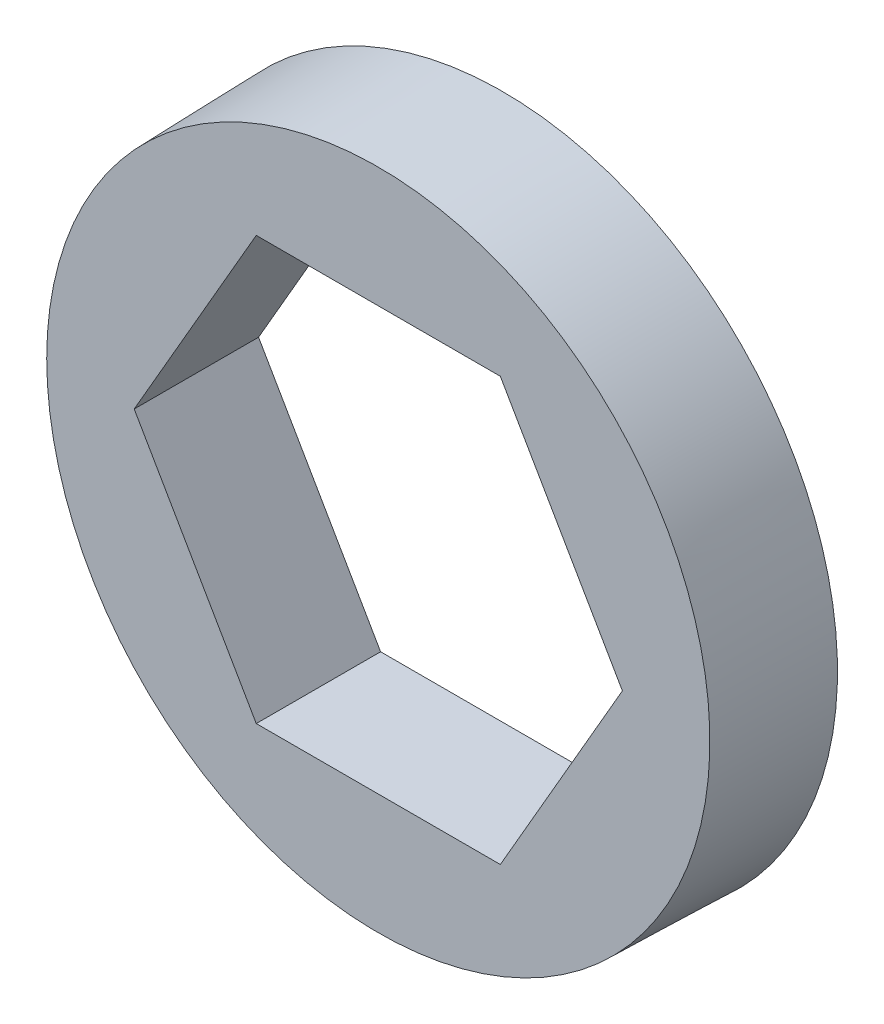
ISO-10303-21;
HEADER;
FILE_DESCRIPTION(('STEP AP214'),'2;1');
FILE_NAME('part.step','',(''),(''),'','','');
FILE_SCHEMA(('AUTOMOTIVE_DESIGN { 1 0 10303 214 1 1 1 1 }'));
ENDSEC;
DATA;
#1=APPLICATION_CONTEXT('core data for automotive mechanical design processes');
#2=APPLICATION_PROTOCOL_DEFINITION('international standard','automotive_design',2000,#1);
#3=PRODUCT_CONTEXT('',#1,'mechanical');
#4=PRODUCT('Part','Part','',(#3));
#5=PRODUCT_RELATED_PRODUCT_CATEGORY('part','',(#4));
#6=PRODUCT_DEFINITION_FORMATION('','',#4);
#7=PRODUCT_DEFINITION_CONTEXT('part definition',#1,'design');
#8=PRODUCT_DEFINITION('design','',#6,#7);
#9=PRODUCT_DEFINITION_SHAPE('','',#8);
#10=(LENGTH_UNIT() NAMED_UNIT(*) SI_UNIT(.MILLI.,.METRE.));
#11=(NAMED_UNIT(*) PLANE_ANGLE_UNIT() SI_UNIT($,.RADIAN.));
#12=(NAMED_UNIT(*) SI_UNIT($,.STERADIAN.) SOLID_ANGLE_UNIT());
#13=UNCERTAINTY_MEASURE_WITH_UNIT(LENGTH_MEASURE(1.E-05),#10,'distance_accuracy_value','');
#14=(GEOMETRIC_REPRESENTATION_CONTEXT(3) GLOBAL_UNCERTAINTY_ASSIGNED_CONTEXT((#13)) GLOBAL_UNIT_ASSIGNED_CONTEXT((#10,
#11,#12)) REPRESENTATION_CONTEXT('',''));
#15=CARTESIAN_POINT('',(0.,0.,0.));
#16=DIRECTION('',(0.,0.,1.));
#17=DIRECTION('',(1.,0.,0.));
#18=AXIS2_PLACEMENT_3D('',#15,#16,#17);
#19=CARTESIAN_POINT('',(0.,0.,0.75));
#20=DIRECTION('',(0.,0.,1.));
#21=DIRECTION('',(1.,0.,0.));
#22=AXIS2_PLACEMENT_3D('',#19,#20,#21);
#23=PLANE('',#22);
#24=CARTESIAN_POINT('',(0.,0.,0.749999999982265));
#25=DIRECTION('',(0.,0.,-1.));
#26=DIRECTION('',(-1.,0.,0.));
#27=AXIS2_PLACEMENT_3D('',#24,#25,#26);
#28=CIRCLE('',#27,3.99999999999778);
#29=CARTESIAN_POINT('',(-3.99999999999778,0.,0.749999999982265));
#30=VERTEX_POINT('',#29);
#31=EDGE_CURVE('E20',#30,#30,#28,.T.);
#32=ORIENTED_EDGE('',*,*,#31,.F.);
#33=EDGE_LOOP('',(#32));
#34=FACE_BOUND('',#33,.T.);
#35=DIRECTION('',(-0.5,-0.866025403784439,0.));
#36=VECTOR('',#35,1.);
#37=CARTESIAN_POINT('',(-1.47224318643355,2.55,0.75));
#38=LINE('',#37,#36);
#39=CARTESIAN_POINT('',(-2.94448637286709,0.,0.750000000000001));
#40=VERTEX_POINT('',#39);
#41=CARTESIAN_POINT('',(-1.47224318643355,2.55,0.75));
#42=VERTEX_POINT('',#41);
#43=EDGE_CURVE('E91',#40,#42,#38,.F.);
#44=ORIENTED_EDGE('',*,*,#43,.T.);
#45=DIRECTION('',(1.,0.,0.));
#46=VECTOR('',#45,1.);
#47=CARTESIAN_POINT('',(1.47224318643355,2.55,0.75));
#48=LINE('',#47,#46);
#49=CARTESIAN_POINT('',(1.47224318643355,2.55,0.75));
#50=VERTEX_POINT('',#49);
#51=EDGE_CURVE('E96',#42,#50,#48,.T.);
#52=ORIENTED_EDGE('',*,*,#51,.T.);
#53=DIRECTION('',(-0.5,0.866025403784439,0.));
#54=VECTOR('',#53,1.);
#55=CARTESIAN_POINT('',(2.94448637286709,0.,0.75));
#56=LINE('',#55,#54);
#57=CARTESIAN_POINT('',(2.94448637286709,0.,0.75));
#58=VERTEX_POINT('',#57);
#59=EDGE_CURVE('E101',#50,#58,#56,.F.);
#60=ORIENTED_EDGE('',*,*,#59,.T.);
#61=DIRECTION('',(0.5,0.866025403784439,0.));
#62=VECTOR('',#61,1.);
#63=CARTESIAN_POINT('',(1.47224318643355,-2.55,0.75));
#64=LINE('',#63,#62);
#65=CARTESIAN_POINT('',(1.47224318643355,-2.55,0.75));
#66=VERTEX_POINT('',#65);
#67=EDGE_CURVE('E71',#58,#66,#64,.F.);
#68=ORIENTED_EDGE('',*,*,#67,.T.);
#69=DIRECTION('',(1.,0.,0.));
#70=VECTOR('',#69,1.);
#71=CARTESIAN_POINT('',(-1.47224318643354,-2.55,0.75));
#72=LINE('',#71,#70);
#73=CARTESIAN_POINT('',(-1.47224318643355,-2.55,0.75));
#74=VERTEX_POINT('',#73);
#75=EDGE_CURVE('E70',#66,#74,#72,.F.);
#76=ORIENTED_EDGE('',*,*,#75,.T.);
#77=DIRECTION('',(0.5,-0.866025403784439,0.));
#78=VECTOR('',#77,1.);
#79=CARTESIAN_POINT('',(-2.94448637286709,0.,0.750000000000001));
#80=LINE('',#79,#78);
#81=EDGE_CURVE('E67',#74,#40,#80,.F.);
#82=ORIENTED_EDGE('',*,*,#81,.T.);
#83=EDGE_LOOP('',(#44,#52,#60,#68,#76,#82));
#84=FACE_BOUND('',#83,.T.);
#85=ADVANCED_FACE('F17',(#34,#84),#23,.T.);
#86=CARTESIAN_POINT('',(-1.47224318643354,-2.55,0.));
#87=DIRECTION('',(0.,-1.,0.));
#88=DIRECTION('',(0.,0.,-1.));
#89=AXIS2_PLACEMENT_3D('',#86,#87,#88);
#90=PLANE('',#89);
#91=DIRECTION('',(0.,0.,1.));
#92=VECTOR('',#91,1.);
#93=CARTESIAN_POINT('',(-1.47224318643355,-2.55,0.));
#94=LINE('',#93,#92);
#95=CARTESIAN_POINT('',(-1.47224318643355,-2.55,-0.75));
#96=VERTEX_POINT('',#95);
#97=EDGE_CURVE('E76',#96,#74,#94,.T.);
#98=ORIENTED_EDGE('',*,*,#97,.T.);
#99=ORIENTED_EDGE('',*,*,#75,.F.);
#100=DIRECTION('',(0.,0.,1.));
#101=VECTOR('',#100,1.);
#102=CARTESIAN_POINT('',(1.47224318643355,-2.55,0.));
#103=LINE('',#102,#101);
#104=CARTESIAN_POINT('',(1.47224318643355,-2.55,-0.75));
#105=VERTEX_POINT('',#104);
#106=EDGE_CURVE('E105',#66,#105,#103,.F.);
#107=ORIENTED_EDGE('',*,*,#106,.T.);
#108=DIRECTION('',(1.,0.,0.));
#109=VECTOR('',#108,1.);
#110=CARTESIAN_POINT('',(0.,-2.55,-0.75));
#111=LINE('',#110,#109);
#112=EDGE_CURVE('E87',#105,#96,#111,.F.);
#113=ORIENTED_EDGE('',*,*,#112,.T.);
#114=EDGE_LOOP('',(#98,#99,#107,#113));
#115=FACE_BOUND('',#114,.T.);
#116=ADVANCED_FACE('F86',(#115),#90,.F.);
#117=CARTESIAN_POINT('',(-2.94448637286709,0.,0.));
#118=DIRECTION('',(-0.866025403784439,-0.5,0.));
#119=DIRECTION('',(0.5,-0.866025403784439,0.));
#120=AXIS2_PLACEMENT_3D('',#117,#118,#119);
#121=PLANE('',#120);
#122=DIRECTION('',(0.,0.,1.));
#123=VECTOR('',#122,1.);
#124=CARTESIAN_POINT('',(-2.94448637286709,0.,0.));
#125=LINE('',#124,#123);
#126=CARTESIAN_POINT('',(-2.94448637286709,0.,-0.75));
#127=VERTEX_POINT('',#126);
#128=EDGE_CURVE('E83',#127,#40,#125,.T.);
#129=ORIENTED_EDGE('',*,*,#128,.T.);
#130=ORIENTED_EDGE('',*,*,#81,.F.);
#131=ORIENTED_EDGE('',*,*,#97,.F.);
#132=DIRECTION('',(-0.5,0.866025403784439,0.));
#133=VECTOR('',#132,1.);
#134=CARTESIAN_POINT('',(-1.47224318643355,-2.55,-0.75));
#135=LINE('',#134,#133);
#136=EDGE_CURVE('E108',#96,#127,#135,.T.);
#137=ORIENTED_EDGE('',*,*,#136,.T.);
#138=EDGE_LOOP('',(#129,#130,#131,#137));
#139=FACE_BOUND('',#138,.T.);
#140=ADVANCED_FACE('F80',(#139),#121,.F.);
#141=CARTESIAN_POINT('',(-1.47224318643355,2.55,0.));
#142=DIRECTION('',(-0.866025403784439,0.5,0.));
#143=DIRECTION('',(-0.5,-0.866025403784439,0.));
#144=AXIS2_PLACEMENT_3D('',#141,#142,#143);
#145=PLANE('',#144);
#146=DIRECTION('',(0.,0.,1.));
#147=VECTOR('',#146,1.);
#148=CARTESIAN_POINT('',(-1.47224318643355,2.55,0.));
#149=LINE('',#148,#147);
#150=CARTESIAN_POINT('',(-1.47224318643355,2.55,-0.75));
#151=VERTEX_POINT('',#150);
#152=EDGE_CURVE('E93',#151,#42,#149,.T.);
#153=ORIENTED_EDGE('',*,*,#152,.T.);
#154=ORIENTED_EDGE('',*,*,#43,.F.);
#155=ORIENTED_EDGE('',*,*,#128,.F.);
#156=DIRECTION('',(0.5,0.866025403784439,0.));
#157=VECTOR('',#156,1.);
#158=CARTESIAN_POINT('',(-2.94448637286709,0.,-0.75));
#159=LINE('',#158,#157);
#160=EDGE_CURVE('E110',#127,#151,#159,.T.);
#161=ORIENTED_EDGE('',*,*,#160,.T.);
#162=EDGE_LOOP('',(#153,#154,#155,#161));
#163=FACE_BOUND('',#162,.T.);
#164=ADVANCED_FACE('F132',(#163),#145,.F.);
#165=CARTESIAN_POINT('',(1.47224318643355,2.55,0.));
#166=DIRECTION('',(0.,1.,0.));
#167=DIRECTION('',(0.,0.,1.));
#168=AXIS2_PLACEMENT_3D('',#165,#166,#167);
#169=PLANE('',#168);
#170=DIRECTION('',(0.,0.,1.));
#171=VECTOR('',#170,1.);
#172=CARTESIAN_POINT('',(1.47224318643355,2.55,0.));
#173=LINE('',#172,#171);
#174=CARTESIAN_POINT('',(1.47224318643355,2.55,-0.75));
#175=VERTEX_POINT('',#174);
#176=EDGE_CURVE('E98',#175,#50,#173,.T.);
#177=ORIENTED_EDGE('',*,*,#176,.T.);
#178=ORIENTED_EDGE('',*,*,#51,.F.);
#179=ORIENTED_EDGE('',*,*,#152,.F.);
#180=DIRECTION('',(1.,0.,0.));
#181=VECTOR('',#180,1.);
#182=CARTESIAN_POINT('',(0.,2.55,-0.75));
#183=LINE('',#182,#181);
#184=EDGE_CURVE('E113',#151,#175,#183,.T.);
#185=ORIENTED_EDGE('',*,*,#184,.T.);
#186=EDGE_LOOP('',(#177,#178,#179,#185));
#187=FACE_BOUND('',#186,.T.);
#188=ADVANCED_FACE('F129',(#187),#169,.F.);
#189=CARTESIAN_POINT('',(2.94448637286709,0.,0.));
#190=DIRECTION('',(0.866025403784439,0.5,0.));
#191=DIRECTION('',(-0.5,0.866025403784439,0.));
#192=AXIS2_PLACEMENT_3D('',#189,#190,#191);
#193=PLANE('',#192);
#194=DIRECTION('',(0.,0.,1.));
#195=VECTOR('',#194,1.);
#196=CARTESIAN_POINT('',(2.94448637286709,0.,0.));
#197=LINE('',#196,#195);
#198=CARTESIAN_POINT('',(2.94448637286709,0.,-0.75));
#199=VERTEX_POINT('',#198);
#200=EDGE_CURVE('E34',#199,#58,#197,.T.);
#201=ORIENTED_EDGE('',*,*,#200,.T.);
#202=ORIENTED_EDGE('',*,*,#59,.F.);
#203=ORIENTED_EDGE('',*,*,#176,.F.);
#204=DIRECTION('',(0.5,-0.866025403784439,0.));
#205=VECTOR('',#204,1.);
#206=CARTESIAN_POINT('',(1.47224318643355,2.55,-0.75));
#207=LINE('',#206,#205);
#208=EDGE_CURVE('E116',#175,#199,#207,.T.);
#209=ORIENTED_EDGE('',*,*,#208,.T.);
#210=EDGE_LOOP('',(#201,#202,#203,#209));
#211=FACE_BOUND('',#210,.T.);
#212=ADVANCED_FACE('F125',(#211),#193,.F.);
#213=CARTESIAN_POINT('',(1.47224318643355,-2.55,0.));
#214=DIRECTION('',(0.866025403784439,-0.5,0.));
#215=DIRECTION('',(0.5,0.866025403784439,0.));
#216=AXIS2_PLACEMENT_3D('',#213,#214,#215);
#217=PLANE('',#216);
#218=ORIENTED_EDGE('',*,*,#106,.F.);
#219=ORIENTED_EDGE('',*,*,#67,.F.);
#220=ORIENTED_EDGE('',*,*,#200,.F.);
#221=DIRECTION('',(-0.5,-0.866025403784439,0.));
#222=VECTOR('',#221,1.);
#223=CARTESIAN_POINT('',(2.94448637286709,0.,-0.75));
#224=LINE('',#223,#222);
#225=EDGE_CURVE('E26',#199,#105,#224,.T.);
#226=ORIENTED_EDGE('',*,*,#225,.T.);
#227=EDGE_LOOP('',(#218,#219,#220,#226));
#228=FACE_BOUND('',#227,.T.);
#229=ADVANCED_FACE('F119',(#228),#217,.F.);
#230=CARTESIAN_POINT('',(0.,0.,-0.749999999982265));
#231=DIRECTION('',(0.,0.,-1.));
#232=DIRECTION('',(-1.,0.,0.));
#233=AXIS2_PLACEMENT_3D('',#230,#231,#232);
#234=CONICAL_SURFACE('',#233,4.03927888230626,0.0261799387503542);
#235=ORIENTED_EDGE('',*,*,#31,.T.);
#236=EDGE_LOOP('',(#235));
#237=FACE_BOUND('',#236,.T.);
#238=CARTESIAN_POINT('',(0.,0.,-0.749999999982265));
#239=DIRECTION('',(0.,0.,-1.));
#240=DIRECTION('',(-1.,0.,0.));
#241=AXIS2_PLACEMENT_3D('',#238,#239,#240);
#242=CIRCLE('',#241,4.03927888230626);
#243=CARTESIAN_POINT('',(-4.03927888230626,0.,-0.749999999982265));
#244=VERTEX_POINT('',#243);
#245=EDGE_CURVE('E10',#244,#244,#242,.F.);
#246=ORIENTED_EDGE('',*,*,#245,.T.);
#247=EDGE_LOOP('',(#246));
#248=FACE_BOUND('',#247,.T.);
#249=ADVANCED_FACE('F143',(#237,#248),#234,.T.);
#250=CARTESIAN_POINT('',(0.,0.,-0.75));
#251=DIRECTION('',(0.,0.,1.));
#252=DIRECTION('',(1.,0.,0.));
#253=AXIS2_PLACEMENT_3D('',#250,#251,#252);
#254=PLANE('',#253);
#255=ORIENTED_EDGE('',*,*,#245,.F.);
#256=EDGE_LOOP('',(#255));
#257=FACE_BOUND('',#256,.T.);
#258=ORIENTED_EDGE('',*,*,#208,.F.);
#259=ORIENTED_EDGE('',*,*,#184,.F.);
#260=ORIENTED_EDGE('',*,*,#160,.F.);
#261=ORIENTED_EDGE('',*,*,#136,.F.);
#262=ORIENTED_EDGE('',*,*,#112,.F.);
#263=ORIENTED_EDGE('',*,*,#225,.F.);
#264=EDGE_LOOP('',(#258,#259,#260,#261,#262,#263));
#265=FACE_BOUND('',#264,.T.);
#266=ADVANCED_FACE('F122',(#257,#265),#254,.F.);
#267=CLOSED_SHELL('',(#85,#116,#140,#164,#188,#212,#229,#249,#266));
#268=MANIFOLD_SOLID_BREP('B1',#267);
#269=ADVANCED_BREP_SHAPE_REPRESENTATION('',(#18,#268),#14);
#270=SHAPE_DEFINITION_REPRESENTATION(#9,#269);
ENDSEC;
END-ISO-10303-21;
